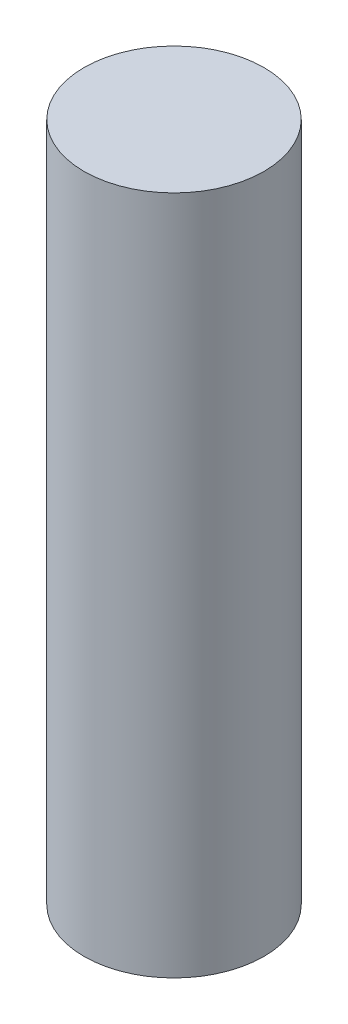
ISO-10303-21;
HEADER;
FILE_DESCRIPTION(('STEP AP214'),'2;1');
FILE_NAME('part.step','',(''),(''),'','','');
FILE_SCHEMA(('AUTOMOTIVE_DESIGN { 1 0 10303 214 1 1 1 1 }'));
ENDSEC;
DATA;
#1=APPLICATION_CONTEXT('core data for automotive mechanical design processes');
#2=APPLICATION_PROTOCOL_DEFINITION('international standard','automotive_design',2000,#1);
#3=PRODUCT_CONTEXT('',#1,'mechanical');
#4=PRODUCT('Part','Part','',(#3));
#5=PRODUCT_RELATED_PRODUCT_CATEGORY('part','',(#4));
#6=PRODUCT_DEFINITION_FORMATION('','',#4);
#7=PRODUCT_DEFINITION_CONTEXT('part definition',#1,'design');
#8=PRODUCT_DEFINITION('design','',#6,#7);
#9=PRODUCT_DEFINITION_SHAPE('','',#8);
#10=(LENGTH_UNIT() NAMED_UNIT(*) SI_UNIT(.MILLI.,.METRE.));
#11=(NAMED_UNIT(*) PLANE_ANGLE_UNIT() SI_UNIT($,.RADIAN.));
#12=(NAMED_UNIT(*) SI_UNIT($,.STERADIAN.) SOLID_ANGLE_UNIT());
#13=UNCERTAINTY_MEASURE_WITH_UNIT(LENGTH_MEASURE(1.E-05),#10,'distance_accuracy_value','');
#14=(GEOMETRIC_REPRESENTATION_CONTEXT(3) GLOBAL_UNCERTAINTY_ASSIGNED_CONTEXT((#13)) GLOBAL_UNIT_ASSIGNED_CONTEXT((#10,
#11,#12)) REPRESENTATION_CONTEXT('',''));
#15=CARTESIAN_POINT('',(0.,0.,0.));
#16=DIRECTION('',(0.,0.,1.));
#17=DIRECTION('',(1.,0.,0.));
#18=AXIS2_PLACEMENT_3D('',#15,#16,#17);
#19=CARTESIAN_POINT('',(70.,68.,0.));
#20=DIRECTION('',(0.,-1.,0.));
#21=DIRECTION('',(0.,0.,-1.));
#22=AXIS2_PLACEMENT_3D('',#19,#20,#21);
#23=CYLINDRICAL_SURFACE('',#22,8.99999999999999);
#24=CARTESIAN_POINT('',(70.,68.,0.));
#25=DIRECTION('',(0.,-1.,0.));
#26=DIRECTION('',(0.,0.,-1.));
#27=AXIS2_PLACEMENT_3D('',#24,#25,#26);
#28=CIRCLE('',#27,8.99999999999999);
#29=CARTESIAN_POINT('',(70.,68.,-8.99999999999999));
#30=VERTEX_POINT('',#29);
#31=EDGE_CURVE('E10',#30,#30,#28,.T.);
#32=ORIENTED_EDGE('',*,*,#31,.T.);
#33=EDGE_LOOP('',(#32));
#34=FACE_BOUND('',#33,.T.);
#35=CARTESIAN_POINT('',(70.,0.,0.));
#36=DIRECTION('',(0.,-1.,0.));
#37=DIRECTION('',(0.,0.,-1.));
#38=AXIS2_PLACEMENT_3D('',#35,#36,#37);
#39=CIRCLE('',#38,8.99999999999999);
#40=CARTESIAN_POINT('',(70.,0.,-8.99999999999999));
#41=VERTEX_POINT('',#40);
#42=EDGE_CURVE('E37',#41,#41,#39,.T.);
#43=ORIENTED_EDGE('',*,*,#42,.F.);
#44=EDGE_LOOP('',(#43));
#45=FACE_BOUND('',#44,.T.);
#46=ADVANCED_FACE('F31',(#34,#45),#23,.T.);
#47=CARTESIAN_POINT('',(79.,68.,0.));
#48=DIRECTION('',(0.,1.,0.));
#49=DIRECTION('',(0.,0.,1.));
#50=AXIS2_PLACEMENT_3D('',#47,#48,#49);
#51=PLANE('',#50);
#52=ORIENTED_EDGE('',*,*,#31,.F.);
#53=EDGE_LOOP('',(#52));
#54=FACE_BOUND('',#53,.T.);
#55=ADVANCED_FACE('F46',(#54),#51,.T.);
#56=CARTESIAN_POINT('',(70.,0.,0.));
#57=DIRECTION('',(0.,-1.,0.));
#58=DIRECTION('',(0.,0.,-1.));
#59=AXIS2_PLACEMENT_3D('',#56,#57,#58);
#60=PLANE('',#59);
#61=ORIENTED_EDGE('',*,*,#42,.T.);
#62=EDGE_LOOP('',(#61));
#63=FACE_BOUND('',#62,.T.);
#64=ADVANCED_FACE('F43',(#63),#60,.T.);
#65=CLOSED_SHELL('',(#46,#55,#64));
#66=MANIFOLD_SOLID_BREP('B2',#65);
#67=ADVANCED_BREP_SHAPE_REPRESENTATION('',(#18,#66),#14);
#68=SHAPE_DEFINITION_REPRESENTATION(#9,#67);
ENDSEC;
END-ISO-10303-21;
